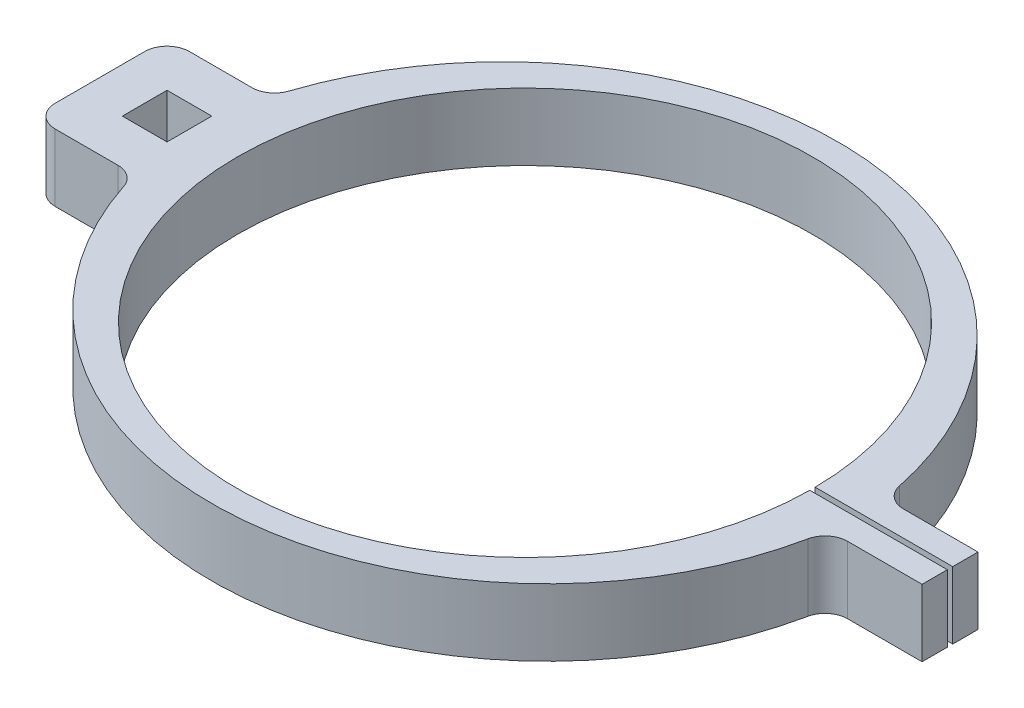
ISO-10303-21;
HEADER;
FILE_DESCRIPTION(('STEP AP214'),'2;1');
FILE_NAME('part.step','',(''),(''),'','','');
FILE_SCHEMA(('AUTOMOTIVE_DESIGN { 1 0 10303 214 1 1 1 1 }'));
ENDSEC;
DATA;
#1=APPLICATION_CONTEXT('core data for automotive mechanical design processes');
#2=APPLICATION_PROTOCOL_DEFINITION('international standard','automotive_design',2000,#1);
#3=PRODUCT_CONTEXT('',#1,'mechanical');
#4=PRODUCT('Part','Part','',(#3));
#5=PRODUCT_RELATED_PRODUCT_CATEGORY('part','',(#4));
#6=PRODUCT_DEFINITION_FORMATION('','',#4);
#7=PRODUCT_DEFINITION_CONTEXT('part definition',#1,'design');
#8=PRODUCT_DEFINITION('design','',#6,#7);
#9=PRODUCT_DEFINITION_SHAPE('','',#8);
#10=(LENGTH_UNIT() NAMED_UNIT(*) SI_UNIT(.MILLI.,.METRE.));
#11=(NAMED_UNIT(*) PLANE_ANGLE_UNIT() SI_UNIT($,.RADIAN.));
#12=(NAMED_UNIT(*) SI_UNIT($,.STERADIAN.) SOLID_ANGLE_UNIT());
#13=UNCERTAINTY_MEASURE_WITH_UNIT(LENGTH_MEASURE(1.E-05),#10,'distance_accuracy_value','');
#14=(GEOMETRIC_REPRESENTATION_CONTEXT(3) GLOBAL_UNCERTAINTY_ASSIGNED_CONTEXT((#13)) GLOBAL_UNIT_ASSIGNED_CONTEXT((#10,
#11,#12)) REPRESENTATION_CONTEXT('',''));
#15=CARTESIAN_POINT('',(0.,0.,0.));
#16=DIRECTION('',(0.,0.,1.));
#17=DIRECTION('',(1.,0.,0.));
#18=AXIS2_PLACEMENT_3D('',#15,#16,#17);
#19=CARTESIAN_POINT('',(0.,4.7625,-3.175));
#20=DIRECTION('',(0.,1.,0.));
#21=DIRECTION('',(0.,0.,1.));
#22=AXIS2_PLACEMENT_3D('',#19,#20,#21);
#23=PLANE('',#22);
#24=DIRECTION('',(-1.,0.,0.));
#25=VECTOR('',#24,1.);
#26=CARTESIAN_POINT('',(-60.325,4.7625,-9.525));
#27=LINE('',#26,#25);
#28=CARTESIAN_POINT('',(-48.2558221875869,4.7625,-9.525));
#29=VERTEX_POINT('',#28);
#30=CARTESIAN_POINT('',(-57.15,4.7625,-9.525));
#31=VERTEX_POINT('',#30);
#32=EDGE_CURVE('E276',#29,#31,#27,.T.);
#33=ORIENTED_EDGE('',*,*,#32,.T.);
#34=CARTESIAN_POINT('',(-57.15,4.7625,-6.35));
#35=DIRECTION('',(0.,1.,0.));
#36=DIRECTION('',(0.,0.,1.));
#37=AXIS2_PLACEMENT_3D('',#34,#35,#36);
#38=CIRCLE('',#37,3.175);
#39=CARTESIAN_POINT('',(-60.325,4.7625,-6.35));
#40=VERTEX_POINT('',#39);
#41=EDGE_CURVE('E392',#31,#40,#38,.T.);
#42=ORIENTED_EDGE('',*,*,#41,.T.);
#43=DIRECTION('',(0.,0.,1.));
#44=VECTOR('',#43,1.);
#45=CARTESIAN_POINT('',(-60.325,4.7625,-9.525));
#46=LINE('',#45,#44);
#47=CARTESIAN_POINT('',(-60.325,4.7625,6.35));
#48=VERTEX_POINT('',#47);
#49=EDGE_CURVE('E280',#40,#48,#46,.T.);
#50=ORIENTED_EDGE('',*,*,#49,.T.);
#51=CARTESIAN_POINT('',(-57.15,4.7625,6.35));
#52=DIRECTION('',(0.,1.,0.));
#53=DIRECTION('',(0.,0.,1.));
#54=AXIS2_PLACEMENT_3D('',#51,#52,#53);
#55=CIRCLE('',#54,3.175);
#56=CARTESIAN_POINT('',(-57.15,4.7625,9.525));
#57=VERTEX_POINT('',#56);
#58=EDGE_CURVE('E63',#48,#57,#55,.T.);
#59=ORIENTED_EDGE('',*,*,#58,.T.);
#60=DIRECTION('',(1.,0.,0.));
#61=VECTOR('',#60,1.);
#62=CARTESIAN_POINT('',(-60.325,4.7625,9.525));
#63=LINE('',#62,#61);
#64=CARTESIAN_POINT('',(-48.2558221875869,4.7625,9.525));
#65=VERTEX_POINT('',#64);
#66=EDGE_CURVE('E283',#57,#65,#63,.T.);
#67=ORIENTED_EDGE('',*,*,#66,.T.);
#68=CARTESIAN_POINT('',(-48.2558221875868,4.7625,12.7));
#69=DIRECTION('',(0.,1.,0.));
#70=DIRECTION('',(0.,0.,1.));
#71=AXIS2_PLACEMENT_3D('',#68,#69,#70);
#72=CIRCLE('',#71,3.175);
#73=CARTESIAN_POINT('',(-45.2398333008627,4.7625,11.7078125));
#74=VERTEX_POINT('',#73);
#75=EDGE_CURVE('E11',#65,#74,#72,.F.);
#76=ORIENTED_EDGE('',*,*,#75,.T.);
#77=CARTESIAN_POINT('',(0.,4.7625,-3.175));
#78=DIRECTION('',(0.,1.,0.));
#79=DIRECTION('',(0.,0.,1.));
#80=AXIS2_PLACEMENT_3D('',#77,#78,#79);
#81=CIRCLE('',#80,47.625);
#82=CARTESIAN_POINT('',(46.632152796198,4.7625,6.498828125));
#83=VERTEX_POINT('',#82);
#84=EDGE_CURVE('E245',#74,#83,#81,.T.);
#85=ORIENTED_EDGE('',*,*,#84,.T.);
#86=CARTESIAN_POINT('',(49.7409629826112,4.7625,7.14375));
#87=DIRECTION('',(0.,1.,0.));
#88=DIRECTION('',(0.,0.,1.));
#89=AXIS2_PLACEMENT_3D('',#86,#87,#88);
#90=CIRCLE('',#89,3.175);
#91=CARTESIAN_POINT('',(49.7409629826112,4.7625,3.96875));
#92=VERTEX_POINT('',#91);
#93=EDGE_CURVE('E410',#83,#92,#90,.F.);
#94=ORIENTED_EDGE('',*,*,#93,.T.);
#95=DIRECTION('',(1.,0.,0.));
#96=VECTOR('',#95,1.);
#97=CARTESIAN_POINT('',(47.0861705911353,4.7625,3.96875));
#98=LINE('',#97,#96);
#99=CARTESIAN_POINT('',(60.325,4.7625,3.96875));
#100=VERTEX_POINT('',#99);
#101=EDGE_CURVE('E249',#92,#100,#98,.T.);
#102=ORIENTED_EDGE('',*,*,#101,.T.);
#103=DIRECTION('',(0.,0.,-1.));
#104=VECTOR('',#103,1.);
#105=CARTESIAN_POINT('',(60.325,4.7625,0.381));
#106=LINE('',#105,#104);
#107=CARTESIAN_POINT('',(60.325,4.7625,0.381));
#108=VERTEX_POINT('',#107);
#109=EDGE_CURVE('E253',#100,#108,#106,.T.);
#110=ORIENTED_EDGE('',*,*,#109,.T.);
#111=DIRECTION('',(-1.,0.,0.));
#112=VECTOR('',#111,1.);
#113=CARTESIAN_POINT('',(40.8033212497463,4.7625,0.381));
#114=LINE('',#113,#112);
#115=CARTESIAN_POINT('',(40.8033212497463,4.7625,0.381));
#116=VERTEX_POINT('',#115);
#117=EDGE_CURVE('E256',#108,#116,#114,.T.);
#118=ORIENTED_EDGE('',*,*,#117,.T.);
#119=CARTESIAN_POINT('',(0.,4.7625,0.));
#120=DIRECTION('',(0.,-1.,0.));
#121=DIRECTION('',(0.,0.,1.));
#122=AXIS2_PLACEMENT_3D('',#119,#120,#121);
#123=CIRCLE('',#122,40.8051);
#124=CARTESIAN_POINT('',(40.8033212497463,4.7625,-0.380999999999996));
#125=VERTEX_POINT('',#124);
#126=EDGE_CURVE('E259',#116,#125,#123,.T.);
#127=ORIENTED_EDGE('',*,*,#126,.T.);
#128=DIRECTION('',(1.,0.,0.));
#129=VECTOR('',#128,1.);
#130=CARTESIAN_POINT('',(40.8033212497463,4.7625,-0.381));
#131=LINE('',#130,#129);
#132=CARTESIAN_POINT('',(60.325,4.7625,-0.381));
#133=VERTEX_POINT('',#132);
#134=EDGE_CURVE('E262',#125,#133,#131,.T.);
#135=ORIENTED_EDGE('',*,*,#134,.T.);
#136=DIRECTION('',(0.,0.,-1.));
#137=VECTOR('',#136,1.);
#138=CARTESIAN_POINT('',(60.325,4.7625,-3.96875));
#139=LINE('',#138,#137);
#140=CARTESIAN_POINT('',(60.325,4.7625,-3.96875));
#141=VERTEX_POINT('',#140);
#142=EDGE_CURVE('E265',#133,#141,#139,.T.);
#143=ORIENTED_EDGE('',*,*,#142,.T.);
#144=DIRECTION('',(-1.,0.,0.));
#145=VECTOR('',#144,1.);
#146=CARTESIAN_POINT('',(47.0861705911353,4.7625,-3.96875));
#147=LINE('',#146,#145);
#148=CARTESIAN_POINT('',(49.7409629826112,4.7625,-3.96875));
#149=VERTEX_POINT('',#148);
#150=EDGE_CURVE('E268',#141,#149,#147,.T.);
#151=ORIENTED_EDGE('',*,*,#150,.T.);
#152=CARTESIAN_POINT('',(49.7409629826112,4.7625,-7.14375));
#153=DIRECTION('',(0.,1.,0.));
#154=DIRECTION('',(0.,0.,1.));
#155=AXIS2_PLACEMENT_3D('',#152,#153,#154);
#156=CIRCLE('',#155,3.175);
#157=CARTESIAN_POINT('',(46.632152796198,4.7625,-6.498828125));
#158=VERTEX_POINT('',#157);
#159=EDGE_CURVE('E404',#149,#158,#156,.F.);
#160=ORIENTED_EDGE('',*,*,#159,.T.);
#161=CARTESIAN_POINT('',(0.,4.7625,3.175));
#162=DIRECTION('',(0.,1.,0.));
#163=DIRECTION('',(0.,0.,1.));
#164=AXIS2_PLACEMENT_3D('',#161,#162,#163);
#165=CIRCLE('',#164,47.625);
#166=CARTESIAN_POINT('',(-45.2398333008627,4.7625,-11.7078125));
#167=VERTEX_POINT('',#166);
#168=EDGE_CURVE('E272',#158,#167,#165,.T.);
#169=ORIENTED_EDGE('',*,*,#168,.T.);
#170=CARTESIAN_POINT('',(-48.2558221875869,4.7625,-12.7));
#171=DIRECTION('',(0.,1.,0.));
#172=DIRECTION('',(0.,0.,1.));
#173=AXIS2_PLACEMENT_3D('',#170,#171,#172);
#174=CIRCLE('',#173,3.175);
#175=EDGE_CURVE('E416',#167,#29,#174,.F.);
#176=ORIENTED_EDGE('',*,*,#175,.T.);
#177=EDGE_LOOP('',(#33,#42,#50,#59,#67,#76,#85,#94,#102,#110,#118,#127,#135,#143,#151,#160,#169,#176));
#178=FACE_BOUND('',#177,.T.);
#179=DIRECTION('',(-1.,0.,0.));
#180=VECTOR('',#179,1.);
#181=CARTESIAN_POINT('',(-53.975,4.7625,-3.175));
#182=LINE('',#181,#180);
#183=CARTESIAN_POINT('',(-47.625,4.7625,-3.175));
#184=VERTEX_POINT('',#183);
#185=CARTESIAN_POINT('',(-53.975,4.7625,-3.175));
#186=VERTEX_POINT('',#185);
#187=EDGE_CURVE('E203',#184,#186,#182,.T.);
#188=ORIENTED_EDGE('',*,*,#187,.F.);
#189=DIRECTION('',(0.,0.,-1.));
#190=VECTOR('',#189,1.);
#191=CARTESIAN_POINT('',(-47.625,4.7625,-3.175));
#192=LINE('',#191,#190);
#193=CARTESIAN_POINT('',(-47.625,4.7625,3.175));
#194=VERTEX_POINT('',#193);
#195=EDGE_CURVE('E192',#194,#184,#192,.T.);
#196=ORIENTED_EDGE('',*,*,#195,.F.);
#197=DIRECTION('',(1.,0.,0.));
#198=VECTOR('',#197,1.);
#199=CARTESIAN_POINT('',(-53.975,4.7625,3.175));
#200=LINE('',#199,#198);
#201=CARTESIAN_POINT('',(-53.975,4.7625,3.175));
#202=VERTEX_POINT('',#201);
#203=EDGE_CURVE('E221',#202,#194,#200,.T.);
#204=ORIENTED_EDGE('',*,*,#203,.F.);
#205=DIRECTION('',(0.,0.,1.));
#206=VECTOR('',#205,1.);
#207=CARTESIAN_POINT('',(-53.975,4.7625,-3.175));
#208=LINE('',#207,#206);
#209=EDGE_CURVE('E217',#186,#202,#208,.T.);
#210=ORIENTED_EDGE('',*,*,#209,.F.);
#211=EDGE_LOOP('',(#188,#196,#204,#210));
#212=FACE_BOUND('',#211,.T.);
#213=ADVANCED_FACE('F40',(#178,#212),#23,.T.);
#214=CARTESIAN_POINT('',(0.,-4.7625,-3.175));
#215=DIRECTION('',(0.,1.,0.));
#216=DIRECTION('',(0.,0.,1.));
#217=AXIS2_PLACEMENT_3D('',#214,#215,#216);
#218=PLANE('',#217);
#219=DIRECTION('',(0.,0.,1.));
#220=VECTOR('',#219,1.);
#221=CARTESIAN_POINT('',(-60.325,-4.7625,-9.525));
#222=LINE('',#221,#220);
#223=CARTESIAN_POINT('',(-60.325,-4.7625,-6.35));
#224=VERTEX_POINT('',#223);
#225=CARTESIAN_POINT('',(-60.325,-4.7625,6.35));
#226=VERTEX_POINT('',#225);
#227=EDGE_CURVE('E320',#224,#226,#222,.T.);
#228=ORIENTED_EDGE('',*,*,#227,.F.);
#229=CARTESIAN_POINT('',(-57.15,-4.7625,-6.35));
#230=DIRECTION('',(0.,1.,0.));
#231=DIRECTION('',(0.,0.,1.));
#232=AXIS2_PLACEMENT_3D('',#229,#230,#231);
#233=CIRCLE('',#232,3.175);
#234=CARTESIAN_POINT('',(-57.15,-4.7625,-9.525));
#235=VERTEX_POINT('',#234);
#236=EDGE_CURVE('E387',#224,#235,#233,.F.);
#237=ORIENTED_EDGE('',*,*,#236,.T.);
#238=DIRECTION('',(-1.,0.,0.));
#239=VECTOR('',#238,1.);
#240=CARTESIAN_POINT('',(-60.325,-4.7625,-9.525));
#241=LINE('',#240,#239);
#242=CARTESIAN_POINT('',(-48.2558221875869,-4.7625,-9.525));
#243=VERTEX_POINT('',#242);
#244=EDGE_CURVE('E316',#243,#235,#241,.T.);
#245=ORIENTED_EDGE('',*,*,#244,.F.);
#246=CARTESIAN_POINT('',(-48.2558221875869,-4.7625,-12.7));
#247=DIRECTION('',(0.,1.,0.));
#248=DIRECTION('',(0.,0.,1.));
#249=AXIS2_PLACEMENT_3D('',#246,#247,#248);
#250=CIRCLE('',#249,3.175);
#251=CARTESIAN_POINT('',(-45.2398333008627,-4.7625,-11.7078125));
#252=VERTEX_POINT('',#251);
#253=EDGE_CURVE('E413',#243,#252,#250,.T.);
#254=ORIENTED_EDGE('',*,*,#253,.T.);
#255=CARTESIAN_POINT('',(0.,-4.7625,3.175));
#256=DIRECTION('',(0.,1.,0.));
#257=DIRECTION('',(0.,0.,1.));
#258=AXIS2_PLACEMENT_3D('',#255,#256,#257);
#259=CIRCLE('',#258,47.625);
#260=CARTESIAN_POINT('',(46.632152796198,-4.7625,-6.498828125));
#261=VERTEX_POINT('',#260);
#262=EDGE_CURVE('E312',#261,#252,#259,.T.);
#263=ORIENTED_EDGE('',*,*,#262,.F.);
#264=CARTESIAN_POINT('',(49.7409629826112,-4.7625,-7.14375));
#265=DIRECTION('',(0.,1.,0.));
#266=DIRECTION('',(0.,0.,1.));
#267=AXIS2_PLACEMENT_3D('',#264,#265,#266);
#268=CIRCLE('',#267,3.175);
#269=CARTESIAN_POINT('',(49.7409629826112,-4.7625,-3.96875));
#270=VERTEX_POINT('',#269);
#271=EDGE_CURVE('E401',#261,#270,#268,.T.);
#272=ORIENTED_EDGE('',*,*,#271,.T.);
#273=DIRECTION('',(-1.,0.,0.));
#274=VECTOR('',#273,1.);
#275=CARTESIAN_POINT('',(47.0861705911353,-4.7625,-3.96875));
#276=LINE('',#275,#274);
#277=CARTESIAN_POINT('',(60.325,-4.7625,-3.96875));
#278=VERTEX_POINT('',#277);
#279=EDGE_CURVE('E308',#278,#270,#276,.T.);
#280=ORIENTED_EDGE('',*,*,#279,.F.);
#281=DIRECTION('',(0.,0.,-1.));
#282=VECTOR('',#281,1.);
#283=CARTESIAN_POINT('',(60.325,-4.7625,-3.96875));
#284=LINE('',#283,#282);
#285=CARTESIAN_POINT('',(60.325,-4.7625,-0.381));
#286=VERTEX_POINT('',#285);
#287=EDGE_CURVE('E305',#286,#278,#284,.T.);
#288=ORIENTED_EDGE('',*,*,#287,.F.);
#289=DIRECTION('',(1.,0.,0.));
#290=VECTOR('',#289,1.);
#291=CARTESIAN_POINT('',(40.8033212497463,-4.7625,-0.381));
#292=LINE('',#291,#290);
#293=CARTESIAN_POINT('',(40.8033212497463,-4.7625,-0.380999999999996));
#294=VERTEX_POINT('',#293);
#295=EDGE_CURVE('E302',#294,#286,#292,.T.);
#296=ORIENTED_EDGE('',*,*,#295,.F.);
#297=CARTESIAN_POINT('',(0.,-4.7625,0.));
#298=DIRECTION('',(0.,-1.,0.));
#299=DIRECTION('',(0.,0.,1.));
#300=AXIS2_PLACEMENT_3D('',#297,#298,#299);
#301=CIRCLE('',#300,40.8051);
#302=CARTESIAN_POINT('',(40.8033212497463,-4.7625,0.381));
#303=VERTEX_POINT('',#302);
#304=EDGE_CURVE('E299',#303,#294,#301,.T.);
#305=ORIENTED_EDGE('',*,*,#304,.F.);
#306=DIRECTION('',(-1.,0.,0.));
#307=VECTOR('',#306,1.);
#308=CARTESIAN_POINT('',(40.8033212497463,-4.7625,0.381));
#309=LINE('',#308,#307);
#310=CARTESIAN_POINT('',(60.325,-4.7625,0.381));
#311=VERTEX_POINT('',#310);
#312=EDGE_CURVE('E296',#311,#303,#309,.T.);
#313=ORIENTED_EDGE('',*,*,#312,.F.);
#314=DIRECTION('',(0.,0.,-1.));
#315=VECTOR('',#314,1.);
#316=CARTESIAN_POINT('',(60.325,-4.7625,0.381));
#317=LINE('',#316,#315);
#318=CARTESIAN_POINT('',(60.325,-4.7625,3.96875));
#319=VERTEX_POINT('',#318);
#320=EDGE_CURVE('E293',#319,#311,#317,.T.);
#321=ORIENTED_EDGE('',*,*,#320,.F.);
#322=DIRECTION('',(1.,0.,0.));
#323=VECTOR('',#322,1.);
#324=CARTESIAN_POINT('',(47.0861705911353,-4.7625,3.96875));
#325=LINE('',#324,#323);
#326=CARTESIAN_POINT('',(49.7409629826112,-4.7625,3.96875));
#327=VERTEX_POINT('',#326);
#328=EDGE_CURVE('E290',#327,#319,#325,.T.);
#329=ORIENTED_EDGE('',*,*,#328,.F.);
#330=CARTESIAN_POINT('',(49.7409629826112,-4.7625,7.14375));
#331=DIRECTION('',(0.,1.,0.));
#332=DIRECTION('',(0.,0.,1.));
#333=AXIS2_PLACEMENT_3D('',#330,#331,#332);
#334=CIRCLE('',#333,3.175);
#335=CARTESIAN_POINT('',(46.632152796198,-4.7625,6.498828125));
#336=VERTEX_POINT('',#335);
#337=EDGE_CURVE('E407',#327,#336,#334,.T.);
#338=ORIENTED_EDGE('',*,*,#337,.T.);
#339=CARTESIAN_POINT('',(0.,-4.7625,-3.175));
#340=DIRECTION('',(0.,1.,0.));
#341=DIRECTION('',(0.,0.,1.));
#342=AXIS2_PLACEMENT_3D('',#339,#340,#341);
#343=CIRCLE('',#342,47.625);
#344=CARTESIAN_POINT('',(-45.2398333008627,-4.7625,11.7078125));
#345=VERTEX_POINT('',#344);
#346=EDGE_CURVE('E212',#345,#336,#343,.T.);
#347=ORIENTED_EDGE('',*,*,#346,.F.);
#348=CARTESIAN_POINT('',(-48.2558221875868,-4.7625,12.7));
#349=DIRECTION('',(0.,1.,0.));
#350=DIRECTION('',(0.,0.,1.));
#351=AXIS2_PLACEMENT_3D('',#348,#349,#350);
#352=CIRCLE('',#351,3.175);
#353=CARTESIAN_POINT('',(-48.2558221875869,-4.7625,9.525));
#354=VERTEX_POINT('',#353);
#355=EDGE_CURVE('E49',#345,#354,#352,.T.);
#356=ORIENTED_EDGE('',*,*,#355,.T.);
#357=DIRECTION('',(1.,0.,0.));
#358=VECTOR('',#357,1.);
#359=CARTESIAN_POINT('',(-60.325,-4.7625,9.525));
#360=LINE('',#359,#358);
#361=CARTESIAN_POINT('',(-57.15,-4.7625,9.525));
#362=VERTEX_POINT('',#361);
#363=EDGE_CURVE('E250',#362,#354,#360,.T.);
#364=ORIENTED_EDGE('',*,*,#363,.F.);
#365=CARTESIAN_POINT('',(-57.15,-4.7625,6.35));
#366=DIRECTION('',(0.,1.,0.));
#367=DIRECTION('',(0.,0.,1.));
#368=AXIS2_PLACEMENT_3D('',#365,#366,#367);
#369=CIRCLE('',#368,3.175);
#370=EDGE_CURVE('E384',#362,#226,#369,.F.);
#371=ORIENTED_EDGE('',*,*,#370,.T.);
#372=EDGE_LOOP('',(#228,#237,#245,#254,#263,#272,#280,#288,#296,#305,#313,#321,#329,#338,#347,
#356,#364,#371));
#373=FACE_BOUND('',#372,.T.);
#374=DIRECTION('',(0.,0.,-1.));
#375=VECTOR('',#374,1.);
#376=CARTESIAN_POINT('',(-47.625,-4.7625,-3.175));
#377=LINE('',#376,#375);
#378=CARTESIAN_POINT('',(-47.625,-4.7625,3.175));
#379=VERTEX_POINT('',#378);
#380=CARTESIAN_POINT('',(-47.625,-4.7625,-3.175));
#381=VERTEX_POINT('',#380);
#382=EDGE_CURVE('E226',#379,#381,#377,.T.);
#383=ORIENTED_EDGE('',*,*,#382,.T.);
#384=DIRECTION('',(-1.,0.,0.));
#385=VECTOR('',#384,1.);
#386=CARTESIAN_POINT('',(-53.975,-4.7625,-3.175));
#387=LINE('',#386,#385);
#388=CARTESIAN_POINT('',(-53.975,-4.7625,-3.175));
#389=VERTEX_POINT('',#388);
#390=EDGE_CURVE('E210',#381,#389,#387,.T.);
#391=ORIENTED_EDGE('',*,*,#390,.T.);
#392=DIRECTION('',(0.,0.,1.));
#393=VECTOR('',#392,1.);
#394=CARTESIAN_POINT('',(-53.975,-4.7625,-3.175));
#395=LINE('',#394,#393);
#396=CARTESIAN_POINT('',(-53.975,-4.7625,3.175));
#397=VERTEX_POINT('',#396);
#398=EDGE_CURVE('E231',#389,#397,#395,.T.);
#399=ORIENTED_EDGE('',*,*,#398,.T.);
#400=DIRECTION('',(1.,0.,0.));
#401=VECTOR('',#400,1.);
#402=CARTESIAN_POINT('',(-53.975,-4.7625,3.175));
#403=LINE('',#402,#401);
#404=EDGE_CURVE('E204',#397,#379,#403,.T.);
#405=ORIENTED_EDGE('',*,*,#404,.T.);
#406=EDGE_LOOP('',(#383,#391,#399,#405));
#407=FACE_BOUND('',#406,.T.);
#408=ADVANCED_FACE('F423',(#373,#407),#218,.F.);
#409=CARTESIAN_POINT('',(0.,4.7625,-3.175));
#410=DIRECTION('',(0.,-1.,0.));
#411=DIRECTION('',(0.,0.,-1.));
#412=AXIS2_PLACEMENT_3D('',#409,#410,#411);
#413=CYLINDRICAL_SURFACE('',#412,47.625);
#414=ORIENTED_EDGE('',*,*,#346,.T.);
#415=DIRECTION('',(0.,-1.,0.));
#416=VECTOR('',#415,1.);
#417=CARTESIAN_POINT('',(46.632152796198,4.7625,6.498828125));
#418=LINE('',#417,#416);
#419=EDGE_CURVE('E367',#336,#83,#418,.F.);
#420=ORIENTED_EDGE('',*,*,#419,.T.);
#421=ORIENTED_EDGE('',*,*,#84,.F.);
#422=DIRECTION('',(0.,-1.,0.));
#423=VECTOR('',#422,1.);
#424=CARTESIAN_POINT('',(-45.2398333008627,4.7625,11.7078125));
#425=LINE('',#424,#423);
#426=EDGE_CURVE('E363',#74,#345,#425,.T.);
#427=ORIENTED_EDGE('',*,*,#426,.T.);
#428=EDGE_LOOP('',(#414,#420,#421,#427));
#429=FACE_BOUND('',#428,.T.);
#430=ADVANCED_FACE('F433',(#429),#413,.T.);
#431=CARTESIAN_POINT('',(47.0861705911353,4.7625,3.96875));
#432=DIRECTION('',(0.,0.,-1.));
#433=DIRECTION('',(-1.,0.,0.));
#434=AXIS2_PLACEMENT_3D('',#431,#432,#433);
#435=PLANE('',#434);
#436=ORIENTED_EDGE('',*,*,#101,.F.);
#437=DIRECTION('',(0.,1.,0.));
#438=VECTOR('',#437,1.);
#439=CARTESIAN_POINT('',(49.7409629826112,-4.7625,3.96875));
#440=LINE('',#439,#438);
#441=EDGE_CURVE('E359',#92,#327,#440,.F.);
#442=ORIENTED_EDGE('',*,*,#441,.T.);
#443=ORIENTED_EDGE('',*,*,#328,.T.);
#444=DIRECTION('',(0.,-1.,0.));
#445=VECTOR('',#444,1.);
#446=CARTESIAN_POINT('',(60.325,4.7625,3.96875));
#447=LINE('',#446,#445);
#448=EDGE_CURVE('E345',#100,#319,#447,.T.);
#449=ORIENTED_EDGE('',*,*,#448,.F.);
#450=EDGE_LOOP('',(#436,#442,#443,#449));
#451=FACE_BOUND('',#450,.T.);
#452=ADVANCED_FACE('F441',(#451),#435,.F.);
#453=CARTESIAN_POINT('',(60.325,4.7625,0.381));
#454=DIRECTION('',(-1.,0.,0.));
#455=DIRECTION('',(0.,0.,1.));
#456=AXIS2_PLACEMENT_3D('',#453,#454,#455);
#457=PLANE('',#456);
#458=ORIENTED_EDGE('',*,*,#320,.T.);
#459=DIRECTION('',(0.,-1.,0.));
#460=VECTOR('',#459,1.);
#461=CARTESIAN_POINT('',(60.325,4.7625,0.381));
#462=LINE('',#461,#460);
#463=EDGE_CURVE('E341',#108,#311,#462,.T.);
#464=ORIENTED_EDGE('',*,*,#463,.F.);
#465=ORIENTED_EDGE('',*,*,#109,.F.);
#466=ORIENTED_EDGE('',*,*,#448,.T.);
#467=EDGE_LOOP('',(#458,#464,#465,#466));
#468=FACE_BOUND('',#467,.T.);
#469=ADVANCED_FACE('F447',(#468),#457,.F.);
#470=CARTESIAN_POINT('',(40.8033212497463,4.7625,0.381));
#471=DIRECTION('',(0.,0.,1.));
#472=DIRECTION('',(1.,0.,0.));
#473=AXIS2_PLACEMENT_3D('',#470,#471,#472);
#474=PLANE('',#473);
#475=ORIENTED_EDGE('',*,*,#312,.T.);
#476=DIRECTION('',(0.,-1.,0.));
#477=VECTOR('',#476,1.);
#478=CARTESIAN_POINT('',(40.8033212497463,4.7625,0.381));
#479=LINE('',#478,#477);
#480=EDGE_CURVE('E337',#116,#303,#479,.T.);
#481=ORIENTED_EDGE('',*,*,#480,.F.);
#482=ORIENTED_EDGE('',*,*,#117,.F.);
#483=ORIENTED_EDGE('',*,*,#463,.T.);
#484=EDGE_LOOP('',(#475,#481,#482,#483));
#485=FACE_BOUND('',#484,.T.);
#486=ADVANCED_FACE('F453',(#485),#474,.F.);
#487=CARTESIAN_POINT('',(0.,4.7625,0.));
#488=DIRECTION('',(0.,-1.,0.));
#489=DIRECTION('',(0.,0.,-1.));
#490=AXIS2_PLACEMENT_3D('',#487,#488,#489);
#491=CYLINDRICAL_SURFACE('',#490,40.8051);
#492=ORIENTED_EDGE('',*,*,#304,.T.);
#493=DIRECTION('',(0.,-1.,0.));
#494=VECTOR('',#493,1.);
#495=CARTESIAN_POINT('',(40.8033212497463,4.7625,-0.380999999999996));
#496=LINE('',#495,#494);
#497=EDGE_CURVE('E333',#125,#294,#496,.T.);
#498=ORIENTED_EDGE('',*,*,#497,.F.);
#499=ORIENTED_EDGE('',*,*,#126,.F.);
#500=ORIENTED_EDGE('',*,*,#480,.T.);
#501=EDGE_LOOP('',(#492,#498,#499,#500));
#502=FACE_BOUND('',#501,.T.);
#503=ADVANCED_FACE('F457',(#502),#491,.F.);
#504=CARTESIAN_POINT('',(40.8033212497463,4.7625,-0.381));
#505=DIRECTION('',(0.,0.,-1.));
#506=DIRECTION('',(-1.,0.,0.));
#507=AXIS2_PLACEMENT_3D('',#504,#505,#506);
#508=PLANE('',#507);
#509=ORIENTED_EDGE('',*,*,#295,.T.);
#510=DIRECTION('',(0.,-1.,0.));
#511=VECTOR('',#510,1.);
#512=CARTESIAN_POINT('',(60.325,4.7625,-0.381));
#513=LINE('',#512,#511);
#514=EDGE_CURVE('E329',#133,#286,#513,.T.);
#515=ORIENTED_EDGE('',*,*,#514,.F.);
#516=ORIENTED_EDGE('',*,*,#134,.F.);
#517=ORIENTED_EDGE('',*,*,#497,.T.);
#518=EDGE_LOOP('',(#509,#515,#516,#517));
#519=FACE_BOUND('',#518,.T.);
#520=ADVANCED_FACE('F462',(#519),#508,.F.);
#521=CARTESIAN_POINT('',(60.325,4.7625,-3.96875));
#522=DIRECTION('',(-1.,0.,0.));
#523=DIRECTION('',(0.,0.,1.));
#524=AXIS2_PLACEMENT_3D('',#521,#522,#523);
#525=PLANE('',#524);
#526=ORIENTED_EDGE('',*,*,#287,.T.);
#527=DIRECTION('',(0.,-1.,0.));
#528=VECTOR('',#527,1.);
#529=CARTESIAN_POINT('',(60.325,4.7625,-3.96875));
#530=LINE('',#529,#528);
#531=EDGE_CURVE('E286',#141,#278,#530,.T.);
#532=ORIENTED_EDGE('',*,*,#531,.F.);
#533=ORIENTED_EDGE('',*,*,#142,.F.);
#534=ORIENTED_EDGE('',*,*,#514,.T.);
#535=EDGE_LOOP('',(#526,#532,#533,#534));
#536=FACE_BOUND('',#535,.T.);
#537=ADVANCED_FACE('F468',(#536),#525,.F.);
#538=CARTESIAN_POINT('',(47.0861705911353,4.7625,-3.96875));
#539=DIRECTION('',(0.,0.,1.));
#540=DIRECTION('',(1.,0.,0.));
#541=AXIS2_PLACEMENT_3D('',#538,#539,#540);
#542=PLANE('',#541);
#543=ORIENTED_EDGE('',*,*,#279,.T.);
#544=DIRECTION('',(0.,1.,0.));
#545=VECTOR('',#544,1.);
#546=CARTESIAN_POINT('',(49.7409629826112,4.7625,-3.96875));
#547=LINE('',#546,#545);
#548=EDGE_CURVE('E356',#270,#149,#547,.T.);
#549=ORIENTED_EDGE('',*,*,#548,.T.);
#550=ORIENTED_EDGE('',*,*,#150,.F.);
#551=ORIENTED_EDGE('',*,*,#531,.T.);
#552=EDGE_LOOP('',(#543,#549,#550,#551));
#553=FACE_BOUND('',#552,.T.);
#554=ADVANCED_FACE('F472',(#553),#542,.F.);
#555=CARTESIAN_POINT('',(0.,4.7625,3.175));
#556=DIRECTION('',(0.,-1.,0.));
#557=DIRECTION('',(0.,0.,-1.));
#558=AXIS2_PLACEMENT_3D('',#555,#556,#557);
#559=CYLINDRICAL_SURFACE('',#558,47.625);
#560=ORIENTED_EDGE('',*,*,#168,.F.);
#561=DIRECTION('',(0.,-1.,0.));
#562=VECTOR('',#561,1.);
#563=CARTESIAN_POINT('',(46.632152796198,4.7625,-6.498828125));
#564=LINE('',#563,#562);
#565=EDGE_CURVE('E352',#158,#261,#564,.T.);
#566=ORIENTED_EDGE('',*,*,#565,.T.);
#567=ORIENTED_EDGE('',*,*,#262,.T.);
#568=DIRECTION('',(0.,-1.,0.));
#569=VECTOR('',#568,1.);
#570=CARTESIAN_POINT('',(-45.2398333008627,4.7625,-11.7078125));
#571=LINE('',#570,#569);
#572=EDGE_CURVE('E349',#252,#167,#571,.F.);
#573=ORIENTED_EDGE('',*,*,#572,.T.);
#574=EDGE_LOOP('',(#560,#566,#567,#573));
#575=FACE_BOUND('',#574,.T.);
#576=ADVANCED_FACE('F480',(#575),#559,.T.);
#577=CARTESIAN_POINT('',(-60.325,4.7625,-9.525));
#578=DIRECTION('',(0.,0.,1.));
#579=DIRECTION('',(1.,0.,0.));
#580=AXIS2_PLACEMENT_3D('',#577,#578,#579);
#581=PLANE('',#580);
#582=ORIENTED_EDGE('',*,*,#32,.F.);
#583=DIRECTION('',(0.,1.,0.));
#584=VECTOR('',#583,1.);
#585=CARTESIAN_POINT('',(-48.2558221875869,-4.7625,-9.525));
#586=LINE('',#585,#584);
#587=EDGE_CURVE('E373',#29,#243,#586,.F.);
#588=ORIENTED_EDGE('',*,*,#587,.T.);
#589=ORIENTED_EDGE('',*,*,#244,.T.);
#590=DIRECTION('',(0.,-1.,0.));
#591=VECTOR('',#590,1.);
#592=CARTESIAN_POINT('',(-57.15,4.7625,-9.525));
#593=LINE('',#592,#591);
#594=EDGE_CURVE('E370',#235,#31,#593,.F.);
#595=ORIENTED_EDGE('',*,*,#594,.T.);
#596=EDGE_LOOP('',(#582,#588,#589,#595));
#597=FACE_BOUND('',#596,.T.);
#598=ADVANCED_FACE('F489',(#597),#581,.F.);
#599=CARTESIAN_POINT('',(-60.325,4.7625,-9.525));
#600=DIRECTION('',(1.,0.,0.));
#601=DIRECTION('',(0.,0.,-1.));
#602=AXIS2_PLACEMENT_3D('',#599,#600,#601);
#603=PLANE('',#602);
#604=ORIENTED_EDGE('',*,*,#49,.F.);
#605=DIRECTION('',(0.,-1.,0.));
#606=VECTOR('',#605,1.);
#607=CARTESIAN_POINT('',(-60.325,4.7625,-6.35));
#608=LINE('',#607,#606);
#609=EDGE_CURVE('E380',#40,#224,#608,.T.);
#610=ORIENTED_EDGE('',*,*,#609,.T.);
#611=ORIENTED_EDGE('',*,*,#227,.T.);
#612=DIRECTION('',(0.,-1.,0.));
#613=VECTOR('',#612,1.);
#614=CARTESIAN_POINT('',(-60.325,4.7625,6.35));
#615=LINE('',#614,#613);
#616=EDGE_CURVE('E377',#226,#48,#615,.F.);
#617=ORIENTED_EDGE('',*,*,#616,.T.);
#618=EDGE_LOOP('',(#604,#610,#611,#617));
#619=FACE_BOUND('',#618,.T.);
#620=ADVANCED_FACE('F497',(#619),#603,.F.);
#621=CARTESIAN_POINT('',(-60.325,4.7625,9.525));
#622=DIRECTION('',(0.,0.,-1.));
#623=DIRECTION('',(-1.,0.,0.));
#624=AXIS2_PLACEMENT_3D('',#621,#622,#623);
#625=PLANE('',#624);
#626=ORIENTED_EDGE('',*,*,#66,.F.);
#627=DIRECTION('',(0.,-1.,0.));
#628=VECTOR('',#627,1.);
#629=CARTESIAN_POINT('',(-57.15,4.7625,9.525));
#630=LINE('',#629,#628);
#631=EDGE_CURVE('E397',#57,#362,#630,.T.);
#632=ORIENTED_EDGE('',*,*,#631,.T.);
#633=ORIENTED_EDGE('',*,*,#363,.T.);
#634=DIRECTION('',(0.,1.,0.));
#635=VECTOR('',#634,1.);
#636=CARTESIAN_POINT('',(-48.2558221875868,4.7625,9.525));
#637=LINE('',#636,#635);
#638=EDGE_CURVE('E56',#354,#65,#637,.T.);
#639=ORIENTED_EDGE('',*,*,#638,.T.);
#640=EDGE_LOOP('',(#626,#632,#633,#639));
#641=FACE_BOUND('',#640,.T.);
#642=ADVANCED_FACE('F427',(#641),#625,.F.);
#643=CARTESIAN_POINT('',(-47.625,4.7625,-3.175));
#644=DIRECTION('',(-1.,0.,0.));
#645=DIRECTION('',(0.,0.,1.));
#646=AXIS2_PLACEMENT_3D('',#643,#644,#645);
#647=PLANE('',#646);
#648=ORIENTED_EDGE('',*,*,#382,.F.);
#649=DIRECTION('',(0.,-1.,0.));
#650=VECTOR('',#649,1.);
#651=CARTESIAN_POINT('',(-47.625,4.7625,3.175));
#652=LINE('',#651,#650);
#653=EDGE_CURVE('E198',#194,#379,#652,.T.);
#654=ORIENTED_EDGE('',*,*,#653,.F.);
#655=ORIENTED_EDGE('',*,*,#195,.T.);
#656=DIRECTION('',(0.,-1.,0.));
#657=VECTOR('',#656,1.);
#658=CARTESIAN_POINT('',(-47.625,4.7625,-3.175));
#659=LINE('',#658,#657);
#660=EDGE_CURVE('E195',#184,#381,#659,.T.);
#661=ORIENTED_EDGE('',*,*,#660,.T.);
#662=EDGE_LOOP('',(#648,#654,#655,#661));
#663=FACE_BOUND('',#662,.T.);
#664=ADVANCED_FACE('F194',(#663),#647,.T.);
#665=CARTESIAN_POINT('',(-53.975,4.7625,-3.175));
#666=DIRECTION('',(0.,0.,1.));
#667=DIRECTION('',(1.,0.,0.));
#668=AXIS2_PLACEMENT_3D('',#665,#666,#667);
#669=PLANE('',#668);
#670=ORIENTED_EDGE('',*,*,#390,.F.);
#671=ORIENTED_EDGE('',*,*,#660,.F.);
#672=ORIENTED_EDGE('',*,*,#187,.T.);
#673=DIRECTION('',(0.,-1.,0.));
#674=VECTOR('',#673,1.);
#675=CARTESIAN_POINT('',(-53.975,4.7625,-3.175));
#676=LINE('',#675,#674);
#677=EDGE_CURVE('E213',#186,#389,#676,.T.);
#678=ORIENTED_EDGE('',*,*,#677,.T.);
#679=EDGE_LOOP('',(#670,#671,#672,#678));
#680=FACE_BOUND('',#679,.T.);
#681=ADVANCED_FACE('F207',(#680),#669,.T.);
#682=CARTESIAN_POINT('',(-53.975,4.7625,-3.175));
#683=DIRECTION('',(1.,0.,0.));
#684=DIRECTION('',(0.,0.,-1.));
#685=AXIS2_PLACEMENT_3D('',#682,#683,#684);
#686=PLANE('',#685);
#687=ORIENTED_EDGE('',*,*,#398,.F.);
#688=ORIENTED_EDGE('',*,*,#677,.F.);
#689=ORIENTED_EDGE('',*,*,#209,.T.);
#690=DIRECTION('',(0.,-1.,0.));
#691=VECTOR('',#690,1.);
#692=CARTESIAN_POINT('',(-53.975,4.7625,3.175));
#693=LINE('',#692,#691);
#694=EDGE_CURVE('E240',#202,#397,#693,.T.);
#695=ORIENTED_EDGE('',*,*,#694,.T.);
#696=EDGE_LOOP('',(#687,#688,#689,#695));
#697=FACE_BOUND('',#696,.T.);
#698=ADVANCED_FACE('F586',(#697),#686,.T.);
#699=CARTESIAN_POINT('',(-53.975,4.7625,3.175));
#700=DIRECTION('',(0.,0.,-1.));
#701=DIRECTION('',(-1.,0.,0.));
#702=AXIS2_PLACEMENT_3D('',#699,#700,#701);
#703=PLANE('',#702);
#704=ORIENTED_EDGE('',*,*,#404,.F.);
#705=ORIENTED_EDGE('',*,*,#694,.F.);
#706=ORIENTED_EDGE('',*,*,#203,.T.);
#707=ORIENTED_EDGE('',*,*,#653,.T.);
#708=EDGE_LOOP('',(#704,#705,#706,#707));
#709=FACE_BOUND('',#708,.T.);
#710=ADVANCED_FACE('F542',(#709),#703,.T.);
#711=CARTESIAN_POINT('',(49.7409629826112,4.7625,-7.14375));
#712=DIRECTION('',(0.,-1.,0.));
#713=DIRECTION('',(0.,0.,-1.));
#714=AXIS2_PLACEMENT_3D('',#711,#712,#713);
#715=CYLINDRICAL_SURFACE('',#714,3.175);
#716=ORIENTED_EDGE('',*,*,#159,.F.);
#717=ORIENTED_EDGE('',*,*,#548,.F.);
#718=ORIENTED_EDGE('',*,*,#271,.F.);
#719=ORIENTED_EDGE('',*,*,#565,.F.);
#720=EDGE_LOOP('',(#716,#717,#718,#719));
#721=FACE_BOUND('',#720,.T.);
#722=ADVANCED_FACE('F475',(#721),#715,.F.);
#723=CARTESIAN_POINT('',(49.7409629826112,4.7625,7.14375));
#724=DIRECTION('',(0.,-1.,0.));
#725=DIRECTION('',(0.,0.,-1.));
#726=AXIS2_PLACEMENT_3D('',#723,#724,#725);
#727=CYLINDRICAL_SURFACE('',#726,3.175);
#728=ORIENTED_EDGE('',*,*,#93,.F.);
#729=ORIENTED_EDGE('',*,*,#419,.F.);
#730=ORIENTED_EDGE('',*,*,#337,.F.);
#731=ORIENTED_EDGE('',*,*,#441,.F.);
#732=EDGE_LOOP('',(#728,#729,#730,#731));
#733=FACE_BOUND('',#732,.T.);
#734=ADVANCED_FACE('F436',(#733),#727,.F.);
#735=CARTESIAN_POINT('',(-48.2558221875869,4.7625,-12.7));
#736=DIRECTION('',(0.,-1.,0.));
#737=DIRECTION('',(0.,0.,-1.));
#738=AXIS2_PLACEMENT_3D('',#735,#736,#737);
#739=CYLINDRICAL_SURFACE('',#738,3.175);
#740=ORIENTED_EDGE('',*,*,#175,.F.);
#741=ORIENTED_EDGE('',*,*,#572,.F.);
#742=ORIENTED_EDGE('',*,*,#253,.F.);
#743=ORIENTED_EDGE('',*,*,#587,.F.);
#744=EDGE_LOOP('',(#740,#741,#742,#743));
#745=FACE_BOUND('',#744,.T.);
#746=ADVANCED_FACE('F484',(#745),#739,.F.);
#747=CARTESIAN_POINT('',(-57.15,4.7625,-6.35));
#748=DIRECTION('',(0.,-1.,0.));
#749=DIRECTION('',(0.,0.,-1.));
#750=AXIS2_PLACEMENT_3D('',#747,#748,#749);
#751=CYLINDRICAL_SURFACE('',#750,3.175);
#752=ORIENTED_EDGE('',*,*,#41,.F.);
#753=ORIENTED_EDGE('',*,*,#594,.F.);
#754=ORIENTED_EDGE('',*,*,#236,.F.);
#755=ORIENTED_EDGE('',*,*,#609,.F.);
#756=EDGE_LOOP('',(#752,#753,#754,#755));
#757=FACE_BOUND('',#756,.T.);
#758=ADVANCED_FACE('F493',(#757),#751,.T.);
#759=CARTESIAN_POINT('',(-57.15,4.7625,6.35));
#760=DIRECTION('',(0.,-1.,0.));
#761=DIRECTION('',(0.,0.,-1.));
#762=AXIS2_PLACEMENT_3D('',#759,#760,#761);
#763=CYLINDRICAL_SURFACE('',#762,3.175);
#764=ORIENTED_EDGE('',*,*,#58,.F.);
#765=ORIENTED_EDGE('',*,*,#616,.F.);
#766=ORIENTED_EDGE('',*,*,#370,.F.);
#767=ORIENTED_EDGE('',*,*,#631,.F.);
#768=EDGE_LOOP('',(#764,#765,#766,#767));
#769=FACE_BOUND('',#768,.T.);
#770=ADVANCED_FACE('F500',(#769),#763,.T.);
#771=CARTESIAN_POINT('',(-48.2558221875868,4.7625,12.7));
#772=DIRECTION('',(0.,-1.,0.));
#773=DIRECTION('',(0.,0.,-1.));
#774=AXIS2_PLACEMENT_3D('',#771,#772,#773);
#775=CYLINDRICAL_SURFACE('',#774,3.175);
#776=ORIENTED_EDGE('',*,*,#75,.F.);
#777=ORIENTED_EDGE('',*,*,#638,.F.);
#778=ORIENTED_EDGE('',*,*,#355,.F.);
#779=ORIENTED_EDGE('',*,*,#426,.F.);
#780=EDGE_LOOP('',(#776,#777,#778,#779));
#781=FACE_BOUND('',#780,.T.);
#782=ADVANCED_FACE('F42',(#781),#775,.F.);
#783=CLOSED_SHELL('',(#213,#408,#430,#452,#469,#486,#503,#520,#537,#554,#576,#598,#620,#642,
#664,#681,#698,#710,#722,#734,#746,#758,#770,#782));
#784=MANIFOLD_SOLID_BREP('B2',#783);
#785=ADVANCED_BREP_SHAPE_REPRESENTATION('',(#18,#784),#14);
#786=SHAPE_DEFINITION_REPRESENTATION(#9,#785);
ENDSEC;
END-ISO-10303-21;
